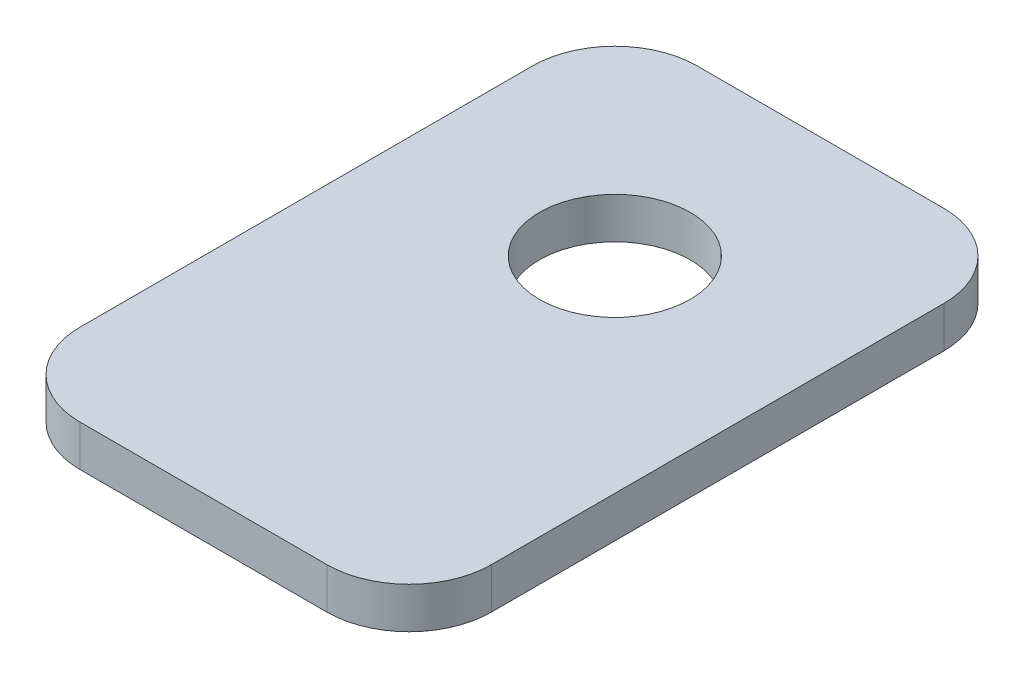
ISO-10303-21;
HEADER;
FILE_DESCRIPTION(('STEP AP214'),'2;1');
FILE_NAME('part.step','',(''),(''),'','','');
FILE_SCHEMA(('AUTOMOTIVE_DESIGN { 1 0 10303 214 1 1 1 1 }'));
ENDSEC;
DATA;
#1=APPLICATION_CONTEXT('core data for automotive mechanical design processes');
#2=APPLICATION_PROTOCOL_DEFINITION('international standard','automotive_design',2000,#1);
#3=PRODUCT_CONTEXT('',#1,'mechanical');
#4=PRODUCT('Part','Part','',(#3));
#5=PRODUCT_RELATED_PRODUCT_CATEGORY('part','',(#4));
#6=PRODUCT_DEFINITION_FORMATION('','',#4);
#7=PRODUCT_DEFINITION_CONTEXT('part definition',#1,'design');
#8=PRODUCT_DEFINITION('design','',#6,#7);
#9=PRODUCT_DEFINITION_SHAPE('','',#8);
#10=(LENGTH_UNIT() NAMED_UNIT(*) SI_UNIT(.MILLI.,.METRE.));
#11=(NAMED_UNIT(*) PLANE_ANGLE_UNIT() SI_UNIT($,.RADIAN.));
#12=(NAMED_UNIT(*) SI_UNIT($,.STERADIAN.) SOLID_ANGLE_UNIT());
#13=UNCERTAINTY_MEASURE_WITH_UNIT(LENGTH_MEASURE(1.E-05),#10,'distance_accuracy_value','');
#14=(GEOMETRIC_REPRESENTATION_CONTEXT(3) GLOBAL_UNCERTAINTY_ASSIGNED_CONTEXT((#13)) GLOBAL_UNIT_ASSIGNED_CONTEXT((#10,
#11,#12)) REPRESENTATION_CONTEXT('',''));
#15=CARTESIAN_POINT('',(0.,0.,0.));
#16=DIRECTION('',(0.,0.,1.));
#17=DIRECTION('',(1.,0.,0.));
#18=AXIS2_PLACEMENT_3D('',#15,#16,#17);
#19=CARTESIAN_POINT('',(0.,1.5,0.));
#20=DIRECTION('',(0.,1.,0.));
#21=DIRECTION('',(0.,0.,1.));
#22=AXIS2_PLACEMENT_3D('',#19,#20,#21);
#23=PLANE('',#22);
#24=CARTESIAN_POINT('',(0.,1.5,0.));
#25=DIRECTION('',(0.,1.,0.));
#26=DIRECTION('',(0.,0.,1.));
#27=AXIS2_PLACEMENT_3D('',#24,#25,#26);
#28=CIRCLE('',#27,2.75);
#29=CARTESIAN_POINT('',(0.,1.5,2.75));
#30=VERTEX_POINT('',#29);
#31=EDGE_CURVE('E157',#30,#30,#28,.F.);
#32=ORIENTED_EDGE('',*,*,#31,.T.);
#33=EDGE_LOOP('',(#32));
#34=FACE_BOUND('',#33,.T.);
#35=DIRECTION('',(1.,0.,0.));
#36=VECTOR('',#35,1.);
#37=CARTESIAN_POINT('',(-7.5,1.5,15.));
#38=LINE('',#37,#36);
#39=CARTESIAN_POINT('',(4.5,1.5,15.));
#40=VERTEX_POINT('',#39);
#41=CARTESIAN_POINT('',(-4.5,1.5,15.));
#42=VERTEX_POINT('',#41);
#43=EDGE_CURVE('E111',#40,#42,#38,.F.);
#44=ORIENTED_EDGE('',*,*,#43,.F.);
#45=CARTESIAN_POINT('',(4.5,1.5,12.));
#46=DIRECTION('',(0.,-1.,0.));
#47=DIRECTION('',(0.,0.,-1.));
#48=AXIS2_PLACEMENT_3D('',#45,#46,#47);
#49=CIRCLE('',#48,3.);
#50=CARTESIAN_POINT('',(7.5,1.5,12.));
#51=VERTEX_POINT('',#50);
#52=EDGE_CURVE('E20',#51,#40,#49,.T.);
#53=ORIENTED_EDGE('',*,*,#52,.F.);
#54=DIRECTION('',(0.,0.,-1.));
#55=VECTOR('',#54,1.);
#56=CARTESIAN_POINT('',(7.5,1.5,15.));
#57=LINE('',#56,#55);
#58=CARTESIAN_POINT('',(7.5,1.5,-4.5));
#59=VERTEX_POINT('',#58);
#60=EDGE_CURVE('E96',#59,#51,#57,.F.);
#61=ORIENTED_EDGE('',*,*,#60,.F.);
#62=CARTESIAN_POINT('',(4.5,1.5,-4.5));
#63=DIRECTION('',(0.,-1.,0.));
#64=DIRECTION('',(0.,0.,-1.));
#65=AXIS2_PLACEMENT_3D('',#62,#63,#64);
#66=CIRCLE('',#65,3.);
#67=CARTESIAN_POINT('',(4.5,1.5,-7.5));
#68=VERTEX_POINT('',#67);
#69=EDGE_CURVE('E120',#68,#59,#66,.T.);
#70=ORIENTED_EDGE('',*,*,#69,.F.);
#71=DIRECTION('',(-1.,0.,0.));
#72=VECTOR('',#71,1.);
#73=CARTESIAN_POINT('',(7.5,1.5,-7.5));
#74=LINE('',#73,#72);
#75=CARTESIAN_POINT('',(-4.5,1.5,-7.5));
#76=VERTEX_POINT('',#75);
#77=EDGE_CURVE('E136',#76,#68,#74,.F.);
#78=ORIENTED_EDGE('',*,*,#77,.F.);
#79=CARTESIAN_POINT('',(-4.5,1.5,-4.5));
#80=DIRECTION('',(0.,-1.,0.));
#81=DIRECTION('',(0.,0.,-1.));
#82=AXIS2_PLACEMENT_3D('',#79,#80,#81);
#83=CIRCLE('',#82,3.);
#84=CARTESIAN_POINT('',(-7.5,1.5,-4.5));
#85=VERTEX_POINT('',#84);
#86=EDGE_CURVE('E165',#85,#76,#83,.T.);
#87=ORIENTED_EDGE('',*,*,#86,.F.);
#88=DIRECTION('',(0.,0.,1.));
#89=VECTOR('',#88,1.);
#90=CARTESIAN_POINT('',(-7.5,1.5,-7.5));
#91=LINE('',#90,#89);
#92=CARTESIAN_POINT('',(-7.5,1.5,12.));
#93=VERTEX_POINT('',#92);
#94=EDGE_CURVE('E131',#93,#85,#91,.F.);
#95=ORIENTED_EDGE('',*,*,#94,.F.);
#96=CARTESIAN_POINT('',(-4.5,1.5,12.));
#97=DIRECTION('',(0.,-1.,0.));
#98=DIRECTION('',(0.,0.,-1.));
#99=AXIS2_PLACEMENT_3D('',#96,#97,#98);
#100=CIRCLE('',#99,3.);
#101=EDGE_CURVE('E162',#42,#93,#100,.T.);
#102=ORIENTED_EDGE('',*,*,#101,.F.);
#103=EDGE_LOOP('',(#44,#53,#61,#70,#78,#87,#95,#102));
#104=FACE_BOUND('',#103,.T.);
#105=ADVANCED_FACE('F17',(#34,#104),#23,.T.);
#106=CARTESIAN_POINT('',(4.5,5.259,12.));
#107=DIRECTION('',(0.,-1.,0.));
#108=DIRECTION('',(0.,0.,-1.));
#109=AXIS2_PLACEMENT_3D('',#106,#107,#108);
#110=CYLINDRICAL_SURFACE('',#109,3.);
#111=DIRECTION('',(0.,1.,0.));
#112=VECTOR('',#111,1.);
#113=CARTESIAN_POINT('',(4.5,0.,15.));
#114=LINE('',#113,#112);
#115=CARTESIAN_POINT('',(4.5,0.,15.));
#116=VERTEX_POINT('',#115);
#117=EDGE_CURVE('E161',#116,#40,#114,.T.);
#118=ORIENTED_EDGE('',*,*,#117,.F.);
#119=CARTESIAN_POINT('',(4.5,0.,12.));
#120=DIRECTION('',(0.,-1.,0.));
#121=DIRECTION('',(0.,0.,-1.));
#122=AXIS2_PLACEMENT_3D('',#119,#120,#121);
#123=CIRCLE('',#122,3.);
#124=CARTESIAN_POINT('',(7.5,0.,12.));
#125=VERTEX_POINT('',#124);
#126=EDGE_CURVE('E118',#116,#125,#123,.F.);
#127=ORIENTED_EDGE('',*,*,#126,.T.);
#128=DIRECTION('',(0.,1.,0.));
#129=VECTOR('',#128,1.);
#130=CARTESIAN_POINT('',(7.5,0.,12.));
#131=LINE('',#130,#129);
#132=EDGE_CURVE('E101',#51,#125,#131,.F.);
#133=ORIENTED_EDGE('',*,*,#132,.F.);
#134=ORIENTED_EDGE('',*,*,#52,.T.);
#135=EDGE_LOOP('',(#118,#127,#133,#134));
#136=FACE_BOUND('',#135,.T.);
#137=ADVANCED_FACE('F117',(#136),#110,.T.);
#138=CARTESIAN_POINT('',(7.5,0.,15.));
#139=DIRECTION('',(1.,0.,0.));
#140=DIRECTION('',(0.,0.,-1.));
#141=AXIS2_PLACEMENT_3D('',#138,#139,#140);
#142=PLANE('',#141);
#143=ORIENTED_EDGE('',*,*,#60,.T.);
#144=ORIENTED_EDGE('',*,*,#132,.T.);
#145=DIRECTION('',(0.,0.,1.));
#146=VECTOR('',#145,1.);
#147=CARTESIAN_POINT('',(7.5,0.,0.));
#148=LINE('',#147,#146);
#149=CARTESIAN_POINT('',(7.5,0.,-4.5));
#150=VERTEX_POINT('',#149);
#151=EDGE_CURVE('E154',#125,#150,#148,.F.);
#152=ORIENTED_EDGE('',*,*,#151,.T.);
#153=DIRECTION('',(0.,-1.,0.));
#154=VECTOR('',#153,1.);
#155=CARTESIAN_POINT('',(7.5,5.259,-4.5));
#156=LINE('',#155,#154);
#157=EDGE_CURVE('E103',#59,#150,#156,.T.);
#158=ORIENTED_EDGE('',*,*,#157,.F.);
#159=EDGE_LOOP('',(#143,#144,#152,#158));
#160=FACE_BOUND('',#159,.T.);
#161=ADVANCED_FACE('F98',(#160),#142,.T.);
#162=CARTESIAN_POINT('',(4.5,5.259,-4.5));
#163=DIRECTION('',(0.,-1.,0.));
#164=DIRECTION('',(0.,0.,-1.));
#165=AXIS2_PLACEMENT_3D('',#162,#163,#164);
#166=CYLINDRICAL_SURFACE('',#165,3.);
#167=ORIENTED_EDGE('',*,*,#157,.T.);
#168=CARTESIAN_POINT('',(4.5,0.,-4.5));
#169=DIRECTION('',(0.,-1.,0.));
#170=DIRECTION('',(0.,0.,-1.));
#171=AXIS2_PLACEMENT_3D('',#168,#169,#170);
#172=CIRCLE('',#171,3.);
#173=CARTESIAN_POINT('',(4.5,0.,-7.5));
#174=VERTEX_POINT('',#173);
#175=EDGE_CURVE('E150',#150,#174,#172,.F.);
#176=ORIENTED_EDGE('',*,*,#175,.T.);
#177=DIRECTION('',(0.,1.,0.));
#178=VECTOR('',#177,1.);
#179=CARTESIAN_POINT('',(4.5,0.,-7.5));
#180=LINE('',#179,#178);
#181=EDGE_CURVE('E138',#68,#174,#180,.F.);
#182=ORIENTED_EDGE('',*,*,#181,.F.);
#183=ORIENTED_EDGE('',*,*,#69,.T.);
#184=EDGE_LOOP('',(#167,#176,#182,#183));
#185=FACE_BOUND('',#184,.T.);
#186=ADVANCED_FACE('F211',(#185),#166,.T.);
#187=CARTESIAN_POINT('',(7.5,0.,-7.5));
#188=DIRECTION('',(0.,0.,-1.));
#189=DIRECTION('',(-1.,0.,0.));
#190=AXIS2_PLACEMENT_3D('',#187,#188,#189);
#191=PLANE('',#190);
#192=ORIENTED_EDGE('',*,*,#77,.T.);
#193=ORIENTED_EDGE('',*,*,#181,.T.);
#194=DIRECTION('',(1.,0.,0.));
#195=VECTOR('',#194,1.);
#196=CARTESIAN_POINT('',(0.,0.,-7.5));
#197=LINE('',#196,#195);
#198=CARTESIAN_POINT('',(-4.5,0.,-7.5));
#199=VERTEX_POINT('',#198);
#200=EDGE_CURVE('E149',#174,#199,#197,.F.);
#201=ORIENTED_EDGE('',*,*,#200,.T.);
#202=DIRECTION('',(0.,-1.,0.));
#203=VECTOR('',#202,1.);
#204=CARTESIAN_POINT('',(-4.5,5.259,-7.5));
#205=LINE('',#204,#203);
#206=EDGE_CURVE('E135',#76,#199,#205,.T.);
#207=ORIENTED_EDGE('',*,*,#206,.F.);
#208=EDGE_LOOP('',(#192,#193,#201,#207));
#209=FACE_BOUND('',#208,.T.);
#210=ADVANCED_FACE('F208',(#209),#191,.T.);
#211=CARTESIAN_POINT('',(-4.5,5.259,-4.5));
#212=DIRECTION('',(0.,-1.,0.));
#213=DIRECTION('',(0.,0.,-1.));
#214=AXIS2_PLACEMENT_3D('',#211,#212,#213);
#215=CYLINDRICAL_SURFACE('',#214,3.);
#216=ORIENTED_EDGE('',*,*,#206,.T.);
#217=CARTESIAN_POINT('',(-4.5,0.,-4.5));
#218=DIRECTION('',(0.,-1.,0.));
#219=DIRECTION('',(0.,0.,-1.));
#220=AXIS2_PLACEMENT_3D('',#217,#218,#219);
#221=CIRCLE('',#220,3.);
#222=CARTESIAN_POINT('',(-7.5,0.,-4.5));
#223=VERTEX_POINT('',#222);
#224=EDGE_CURVE('E145',#199,#223,#221,.F.);
#225=ORIENTED_EDGE('',*,*,#224,.T.);
#226=DIRECTION('',(0.,1.,0.));
#227=VECTOR('',#226,1.);
#228=CARTESIAN_POINT('',(-7.5,0.,-4.5));
#229=LINE('',#228,#227);
#230=EDGE_CURVE('E134',#85,#223,#229,.F.);
#231=ORIENTED_EDGE('',*,*,#230,.F.);
#232=ORIENTED_EDGE('',*,*,#86,.T.);
#233=EDGE_LOOP('',(#216,#225,#231,#232));
#234=FACE_BOUND('',#233,.T.);
#235=ADVANCED_FACE('F206',(#234),#215,.T.);
#236=CARTESIAN_POINT('',(-7.5,0.,-7.5));
#237=DIRECTION('',(-1.,0.,0.));
#238=DIRECTION('',(0.,0.,1.));
#239=AXIS2_PLACEMENT_3D('',#236,#237,#238);
#240=PLANE('',#239);
#241=ORIENTED_EDGE('',*,*,#94,.T.);
#242=ORIENTED_EDGE('',*,*,#230,.T.);
#243=DIRECTION('',(0.,0.,1.));
#244=VECTOR('',#243,1.);
#245=CARTESIAN_POINT('',(-7.5,0.,0.));
#246=LINE('',#245,#244);
#247=CARTESIAN_POINT('',(-7.5,0.,12.));
#248=VERTEX_POINT('',#247);
#249=EDGE_CURVE('E144',#223,#248,#246,.T.);
#250=ORIENTED_EDGE('',*,*,#249,.T.);
#251=DIRECTION('',(0.,-1.,0.));
#252=VECTOR('',#251,1.);
#253=CARTESIAN_POINT('',(-7.5,5.259,12.));
#254=LINE('',#253,#252);
#255=EDGE_CURVE('E130',#93,#248,#254,.T.);
#256=ORIENTED_EDGE('',*,*,#255,.F.);
#257=EDGE_LOOP('',(#241,#242,#250,#256));
#258=FACE_BOUND('',#257,.T.);
#259=ADVANCED_FACE('F204',(#258),#240,.T.);
#260=CARTESIAN_POINT('',(-4.5,5.259,12.));
#261=DIRECTION('',(0.,-1.,0.));
#262=DIRECTION('',(0.,0.,-1.));
#263=AXIS2_PLACEMENT_3D('',#260,#261,#262);
#264=CYLINDRICAL_SURFACE('',#263,3.);
#265=ORIENTED_EDGE('',*,*,#255,.T.);
#266=CARTESIAN_POINT('',(-4.5,0.,12.));
#267=DIRECTION('',(0.,-1.,0.));
#268=DIRECTION('',(0.,0.,-1.));
#269=AXIS2_PLACEMENT_3D('',#266,#267,#268);
#270=CIRCLE('',#269,3.);
#271=CARTESIAN_POINT('',(-4.5,0.,15.));
#272=VERTEX_POINT('',#271);
#273=EDGE_CURVE('E140',#248,#272,#270,.F.);
#274=ORIENTED_EDGE('',*,*,#273,.T.);
#275=DIRECTION('',(0.,1.,0.));
#276=VECTOR('',#275,1.);
#277=CARTESIAN_POINT('',(-4.5,0.,15.));
#278=LINE('',#277,#276);
#279=EDGE_CURVE('E40',#42,#272,#278,.F.);
#280=ORIENTED_EDGE('',*,*,#279,.F.);
#281=ORIENTED_EDGE('',*,*,#101,.T.);
#282=EDGE_LOOP('',(#265,#274,#280,#281));
#283=FACE_BOUND('',#282,.T.);
#284=ADVANCED_FACE('F200',(#283),#264,.T.);
#285=CARTESIAN_POINT('',(-7.5,0.,15.));
#286=DIRECTION('',(0.,0.,1.));
#287=DIRECTION('',(1.,0.,0.));
#288=AXIS2_PLACEMENT_3D('',#285,#286,#287);
#289=PLANE('',#288);
#290=DIRECTION('',(1.,0.,0.));
#291=VECTOR('',#290,1.);
#292=CARTESIAN_POINT('',(0.,0.,15.));
#293=LINE('',#292,#291);
#294=EDGE_CURVE('E27',#272,#116,#293,.T.);
#295=ORIENTED_EDGE('',*,*,#294,.T.);
#296=ORIENTED_EDGE('',*,*,#117,.T.);
#297=ORIENTED_EDGE('',*,*,#43,.T.);
#298=ORIENTED_EDGE('',*,*,#279,.T.);
#299=EDGE_LOOP('',(#295,#296,#297,#298));
#300=FACE_BOUND('',#299,.T.);
#301=ADVANCED_FACE('F194',(#300),#289,.T.);
#302=CARTESIAN_POINT('',(0.,0.,0.));
#303=DIRECTION('',(0.,1.,0.));
#304=DIRECTION('',(0.,0.,1.));
#305=AXIS2_PLACEMENT_3D('',#302,#303,#304);
#306=CYLINDRICAL_SURFACE('',#305,2.75);
#307=ORIENTED_EDGE('',*,*,#31,.F.);
#308=EDGE_LOOP('',(#307));
#309=FACE_BOUND('',#308,.T.);
#310=CARTESIAN_POINT('',(0.,0.,0.));
#311=DIRECTION('',(0.,1.,0.));
#312=DIRECTION('',(0.,0.,1.));
#313=AXIS2_PLACEMENT_3D('',#310,#311,#312);
#314=CIRCLE('',#313,2.75);
#315=CARTESIAN_POINT('',(0.,0.,2.75));
#316=VERTEX_POINT('',#315);
#317=EDGE_CURVE('E11',#316,#316,#314,.F.);
#318=ORIENTED_EDGE('',*,*,#317,.T.);
#319=EDGE_LOOP('',(#318));
#320=FACE_BOUND('',#319,.T.);
#321=ADVANCED_FACE('F226',(#309,#320),#306,.F.);
#322=CARTESIAN_POINT('',(0.,0.,0.));
#323=DIRECTION('',(0.,1.,0.));
#324=DIRECTION('',(0.,0.,1.));
#325=AXIS2_PLACEMENT_3D('',#322,#323,#324);
#326=PLANE('',#325);
#327=ORIENTED_EDGE('',*,*,#317,.F.);
#328=EDGE_LOOP('',(#327));
#329=FACE_BOUND('',#328,.T.);
#330=ORIENTED_EDGE('',*,*,#273,.F.);
#331=ORIENTED_EDGE('',*,*,#249,.F.);
#332=ORIENTED_EDGE('',*,*,#224,.F.);
#333=ORIENTED_EDGE('',*,*,#200,.F.);
#334=ORIENTED_EDGE('',*,*,#175,.F.);
#335=ORIENTED_EDGE('',*,*,#151,.F.);
#336=ORIENTED_EDGE('',*,*,#126,.F.);
#337=ORIENTED_EDGE('',*,*,#294,.F.);
#338=EDGE_LOOP('',(#330,#331,#332,#333,#334,#335,#336,#337));
#339=FACE_BOUND('',#338,.T.);
#340=ADVANCED_FACE('F197',(#329,#339),#326,.F.);
#341=CLOSED_SHELL('',(#105,#137,#161,#186,#210,#235,#259,#284,#301,#321,#340));
#342=MANIFOLD_SOLID_BREP('B1',#341);
#343=ADVANCED_BREP_SHAPE_REPRESENTATION('',(#18,#342),#14);
#344=SHAPE_DEFINITION_REPRESENTATION(#9,#343);
ENDSEC;
END-ISO-10303-21;
